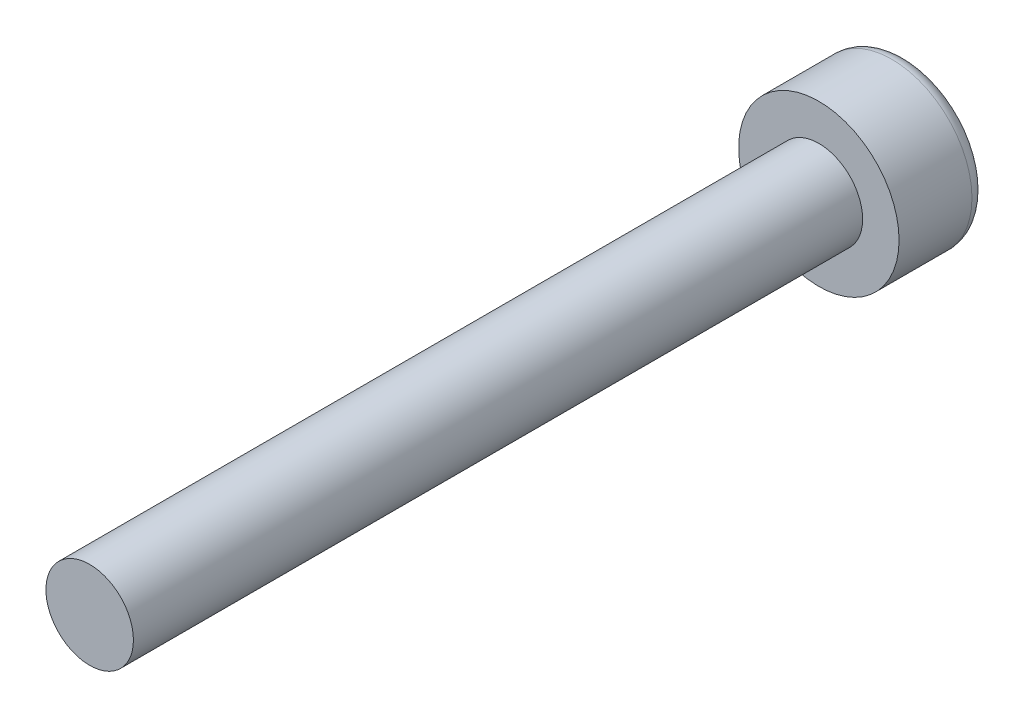
ISO-10303-21;
HEADER;
FILE_DESCRIPTION(('STEP AP214'),'2;1');
FILE_NAME('part.step','',(''),(''),'','','');
FILE_SCHEMA(('AUTOMOTIVE_DESIGN { 1 0 10303 214 1 1 1 1 }'));
ENDSEC;
DATA;
#1=APPLICATION_CONTEXT('core data for automotive mechanical design processes');
#2=APPLICATION_PROTOCOL_DEFINITION('international standard','automotive_design',2000,#1);
#3=PRODUCT_CONTEXT('',#1,'mechanical');
#4=PRODUCT('Part','Part','',(#3));
#5=PRODUCT_RELATED_PRODUCT_CATEGORY('part','',(#4));
#6=PRODUCT_DEFINITION_FORMATION('','',#4);
#7=PRODUCT_DEFINITION_CONTEXT('part definition',#1,'design');
#8=PRODUCT_DEFINITION('design','',#6,#7);
#9=PRODUCT_DEFINITION_SHAPE('','',#8);
#10=(LENGTH_UNIT() NAMED_UNIT(*) SI_UNIT(.MILLI.,.METRE.));
#11=(NAMED_UNIT(*) PLANE_ANGLE_UNIT() SI_UNIT($,.RADIAN.));
#12=(NAMED_UNIT(*) SI_UNIT($,.STERADIAN.) SOLID_ANGLE_UNIT());
#13=UNCERTAINTY_MEASURE_WITH_UNIT(LENGTH_MEASURE(1.E-05),#10,'distance_accuracy_value','');
#14=(GEOMETRIC_REPRESENTATION_CONTEXT(3) GLOBAL_UNCERTAINTY_ASSIGNED_CONTEXT((#13)) GLOBAL_UNIT_ASSIGNED_CONTEXT((#10,
#11,#12)) REPRESENTATION_CONTEXT('',''));
#15=CARTESIAN_POINT('',(0.,0.,0.));
#16=DIRECTION('',(0.,0.,1.));
#17=DIRECTION('',(1.,0.,0.));
#18=AXIS2_PLACEMENT_3D('',#15,#16,#17);
#19=CARTESIAN_POINT('',(0.,0.,3.));
#20=DIRECTION('',(0.,0.,-1.));
#21=DIRECTION('',(-1.,0.,0.));
#22=AXIS2_PLACEMENT_3D('',#19,#20,#21);
#23=CYLINDRICAL_SURFACE('',#22,2.75);
#24=CARTESIAN_POINT('',(0.,0.,0.5));
#25=DIRECTION('',(0.,0.,1.));
#26=DIRECTION('',(1.,0.,0.));
#27=AXIS2_PLACEMENT_3D('',#24,#25,#26);
#28=CIRCLE('',#27,2.75);
#29=CARTESIAN_POINT('',(2.75,0.,0.5));
#30=VERTEX_POINT('',#29);
#31=EDGE_CURVE('E39',#30,#30,#28,.T.);
#32=ORIENTED_EDGE('',*,*,#31,.T.);
#33=EDGE_LOOP('',(#32));
#34=FACE_BOUND('',#33,.T.);
#35=CARTESIAN_POINT('',(0.,0.,3.));
#36=DIRECTION('',(0.,0.,1.));
#37=DIRECTION('',(1.,0.,0.));
#38=AXIS2_PLACEMENT_3D('',#35,#36,#37);
#39=CIRCLE('',#38,2.75);
#40=CARTESIAN_POINT('',(2.75,0.,3.));
#41=VERTEX_POINT('',#40);
#42=EDGE_CURVE('E47',#41,#41,#39,.T.);
#43=ORIENTED_EDGE('',*,*,#42,.F.);
#44=EDGE_LOOP('',(#43));
#45=FACE_BOUND('',#44,.T.);
#46=ADVANCED_FACE('F32',(#34,#45),#23,.T.);
#47=CARTESIAN_POINT('',(0.,0.,3.));
#48=DIRECTION('',(0.,0.,1.));
#49=DIRECTION('',(1.,0.,0.));
#50=AXIS2_PLACEMENT_3D('',#47,#48,#49);
#51=PLANE('',#50);
#52=CARTESIAN_POINT('',(0.,0.,3.));
#53=DIRECTION('',(0.,0.,1.));
#54=DIRECTION('',(1.,0.,0.));
#55=AXIS2_PLACEMENT_3D('',#52,#53,#54);
#56=CIRCLE('',#55,1.5);
#57=CARTESIAN_POINT('',(1.5,0.,3.));
#58=VERTEX_POINT('',#57);
#59=EDGE_CURVE('E43',#58,#58,#56,.T.);
#60=ORIENTED_EDGE('',*,*,#59,.F.);
#61=EDGE_LOOP('',(#60));
#62=FACE_BOUND('',#61,.T.);
#63=ORIENTED_EDGE('',*,*,#42,.T.);
#64=EDGE_LOOP('',(#63));
#65=FACE_BOUND('',#64,.T.);
#66=ADVANCED_FACE('F65',(#62,#65),#51,.T.);
#67=CARTESIAN_POINT('',(0.,0.,0.));
#68=DIRECTION('',(0.,0.,1.));
#69=DIRECTION('',(1.,0.,0.));
#70=AXIS2_PLACEMENT_3D('',#67,#68,#69);
#71=PLANE('',#70);
#72=CARTESIAN_POINT('',(0.,0.,0.));
#73=DIRECTION('',(0.,0.,1.));
#74=DIRECTION('',(1.,0.,0.));
#75=AXIS2_PLACEMENT_3D('',#72,#73,#74);
#76=CIRCLE('',#75,2.25);
#77=CARTESIAN_POINT('',(2.25,0.,0.));
#78=VERTEX_POINT('',#77);
#79=EDGE_CURVE('E10',#78,#78,#76,.F.);
#80=ORIENTED_EDGE('',*,*,#79,.T.);
#81=EDGE_LOOP('',(#80));
#82=FACE_BOUND('',#81,.T.);
#83=ADVANCED_FACE('F61',(#82),#71,.F.);
#84=CARTESIAN_POINT('',(0.,0.,28.));
#85=DIRECTION('',(0.,0.,-1.));
#86=DIRECTION('',(-1.,0.,0.));
#87=AXIS2_PLACEMENT_3D('',#84,#85,#86);
#88=CYLINDRICAL_SURFACE('',#87,1.5);
#89=CARTESIAN_POINT('',(0.,0.,28.));
#90=DIRECTION('',(0.,0.,1.));
#91=DIRECTION('',(1.,0.,0.));
#92=AXIS2_PLACEMENT_3D('',#89,#90,#91);
#93=CIRCLE('',#92,1.5);
#94=CARTESIAN_POINT('',(1.5,0.,28.));
#95=VERTEX_POINT('',#94);
#96=EDGE_CURVE('E51',#95,#95,#93,.T.);
#97=ORIENTED_EDGE('',*,*,#96,.F.);
#98=EDGE_LOOP('',(#97));
#99=FACE_BOUND('',#98,.T.);
#100=ORIENTED_EDGE('',*,*,#59,.T.);
#101=EDGE_LOOP('',(#100));
#102=FACE_BOUND('',#101,.T.);
#103=ADVANCED_FACE('F58',(#99,#102),#88,.T.);
#104=CARTESIAN_POINT('',(0.,0.,28.));
#105=DIRECTION('',(0.,0.,1.));
#106=DIRECTION('',(1.,0.,0.));
#107=AXIS2_PLACEMENT_3D('',#104,#105,#106);
#108=PLANE('',#107);
#109=ORIENTED_EDGE('',*,*,#96,.T.);
#110=EDGE_LOOP('',(#109));
#111=FACE_BOUND('',#110,.T.);
#112=ADVANCED_FACE('F56',(#111),#108,.T.);
#113=CARTESIAN_POINT('',(0.,0.,0.5));
#114=DIRECTION('',(0.,0.,1.));
#115=DIRECTION('',(1.,0.,0.));
#116=AXIS2_PLACEMENT_3D('',#113,#114,#115);
#117=TOROIDAL_SURFACE('',#116,2.25,0.5);
#118=ORIENTED_EDGE('',*,*,#79,.F.);
#119=EDGE_LOOP('',(#118));
#120=FACE_BOUND('',#119,.T.);
#121=ORIENTED_EDGE('',*,*,#31,.F.);
#122=EDGE_LOOP('',(#121));
#123=FACE_BOUND('',#122,.T.);
#124=ADVANCED_FACE('F34',(#120,#123),#117,.T.);
#125=CLOSED_SHELL('',(#46,#66,#83,#103,#112,#124));
#126=MANIFOLD_SOLID_BREP('B2',#125);
#127=ADVANCED_BREP_SHAPE_REPRESENTATION('',(#18,#126),#14);
#128=SHAPE_DEFINITION_REPRESENTATION(#9,#127);
ENDSEC;
END-ISO-10303-21;
